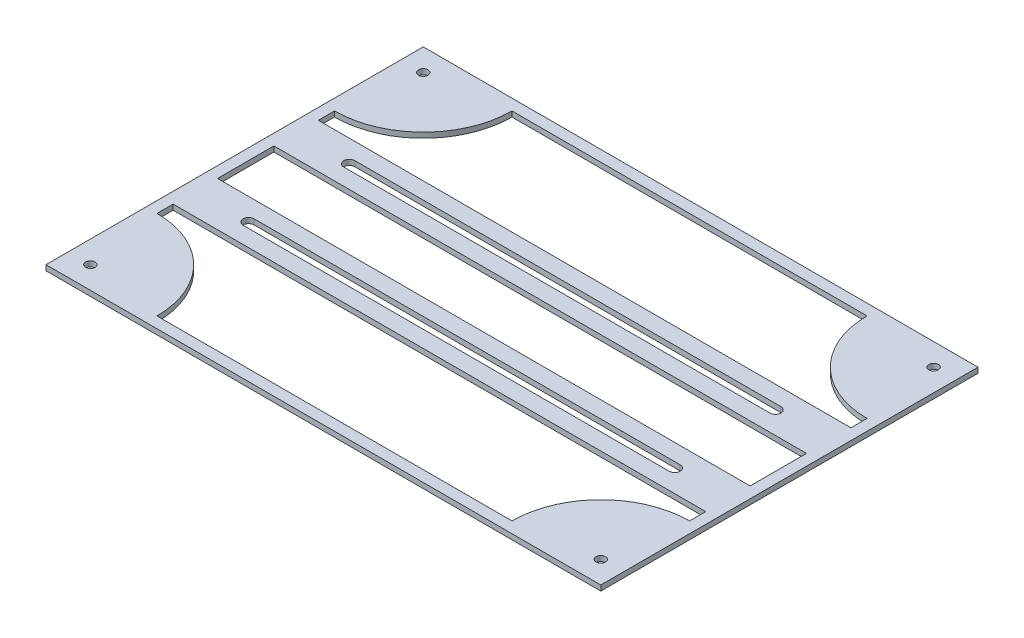
ISO-10303-21;
HEADER;
FILE_DESCRIPTION(('STEP AP214'),'2;1');
FILE_NAME('part.step','',(''),(''),'','','');
FILE_SCHEMA(('AUTOMOTIVE_DESIGN { 1 0 10303 214 1 1 1 1 }'));
ENDSEC;
DATA;
#1=APPLICATION_CONTEXT('core data for automotive mechanical design processes');
#2=APPLICATION_PROTOCOL_DEFINITION('international standard','automotive_design',2000,#1);
#3=PRODUCT_CONTEXT('',#1,'mechanical');
#4=PRODUCT('Part','Part','',(#3));
#5=PRODUCT_RELATED_PRODUCT_CATEGORY('part','',(#4));
#6=PRODUCT_DEFINITION_FORMATION('','',#4);
#7=PRODUCT_DEFINITION_CONTEXT('part definition',#1,'design');
#8=PRODUCT_DEFINITION('design','',#6,#7);
#9=PRODUCT_DEFINITION_SHAPE('','',#8);
#10=(LENGTH_UNIT() NAMED_UNIT(*) SI_UNIT(.MILLI.,.METRE.));
#11=(NAMED_UNIT(*) PLANE_ANGLE_UNIT() SI_UNIT($,.RADIAN.));
#12=(NAMED_UNIT(*) SI_UNIT($,.STERADIAN.) SOLID_ANGLE_UNIT());
#13=UNCERTAINTY_MEASURE_WITH_UNIT(LENGTH_MEASURE(1.E-05),#10,'distance_accuracy_value','');
#14=(GEOMETRIC_REPRESENTATION_CONTEXT(3) GLOBAL_UNCERTAINTY_ASSIGNED_CONTEXT((#13)) GLOBAL_UNIT_ASSIGNED_CONTEXT((#10,
#11,#12)) REPRESENTATION_CONTEXT('',''));
#15=CARTESIAN_POINT('',(0.,0.,0.));
#16=DIRECTION('',(0.,0.,1.));
#17=DIRECTION('',(1.,0.,0.));
#18=AXIS2_PLACEMENT_3D('',#15,#16,#17);
#19=CARTESIAN_POINT('',(-79.375,1.524,0.));
#20=DIRECTION('',(-1.,0.,0.));
#21=DIRECTION('',(0.,0.,1.));
#22=AXIS2_PLACEMENT_3D('',#19,#20,#21);
#23=PLANE('',#22);
#24=DIRECTION('',(0.,0.,-1.));
#25=VECTOR('',#24,1.);
#26=CARTESIAN_POINT('',(-79.375,0.,0.));
#27=LINE('',#26,#25);
#28=CARTESIAN_POINT('',(-79.375,0.,53.975));
#29=VERTEX_POINT('',#28);
#30=CARTESIAN_POINT('',(-79.375,0.,-53.975));
#31=VERTEX_POINT('',#30);
#32=EDGE_CURVE('E398',#29,#31,#27,.T.);
#33=ORIENTED_EDGE('',*,*,#32,.F.);
#34=DIRECTION('',(0.,-1.,0.));
#35=VECTOR('',#34,1.);
#36=CARTESIAN_POINT('',(-79.375,1.524,53.975));
#37=LINE('',#36,#35);
#38=CARTESIAN_POINT('',(-79.375,1.524,53.975));
#39=VERTEX_POINT('',#38);
#40=EDGE_CURVE('E11',#39,#29,#37,.T.);
#41=ORIENTED_EDGE('',*,*,#40,.F.);
#42=DIRECTION('',(0.,0.,-1.));
#43=VECTOR('',#42,1.);
#44=CARTESIAN_POINT('',(-79.375,1.524,0.));
#45=LINE('',#44,#43);
#46=CARTESIAN_POINT('',(-79.375,1.524,-53.975));
#47=VERTEX_POINT('',#46);
#48=EDGE_CURVE('E340',#39,#47,#45,.T.);
#49=ORIENTED_EDGE('',*,*,#48,.T.);
#50=DIRECTION('',(0.,-1.,0.));
#51=VECTOR('',#50,1.);
#52=CARTESIAN_POINT('',(-79.375,1.524,-53.975));
#53=LINE('',#52,#51);
#54=EDGE_CURVE('E409',#47,#31,#53,.T.);
#55=ORIENTED_EDGE('',*,*,#54,.T.);
#56=EDGE_LOOP('',(#33,#41,#49,#55));
#57=FACE_BOUND('',#56,.T.);
#58=ADVANCED_FACE('F37',(#57),#23,.T.);
#59=CARTESIAN_POINT('',(-149.463666266364,1.524,53.975));
#60=DIRECTION('',(0.,0.,1.));
#61=DIRECTION('',(1.,0.,0.));
#62=AXIS2_PLACEMENT_3D('',#59,#60,#61);
#63=PLANE('',#62);
#64=DIRECTION('',(-1.,0.,0.));
#65=VECTOR('',#64,1.);
#66=CARTESIAN_POINT('',(-149.463666266364,0.,53.975));
#67=LINE('',#66,#65);
#68=CARTESIAN_POINT('',(79.375,0.,53.975));
#69=VERTEX_POINT('',#68);
#70=EDGE_CURVE('E401',#69,#29,#67,.T.);
#71=ORIENTED_EDGE('',*,*,#70,.F.);
#72=DIRECTION('',(0.,-1.,0.));
#73=VECTOR('',#72,1.);
#74=CARTESIAN_POINT('',(79.375,1.524,53.975));
#75=LINE('',#74,#73);
#76=CARTESIAN_POINT('',(79.375,1.524,53.975));
#77=VERTEX_POINT('',#76);
#78=EDGE_CURVE('E46',#77,#69,#75,.T.);
#79=ORIENTED_EDGE('',*,*,#78,.F.);
#80=DIRECTION('',(-1.,0.,0.));
#81=VECTOR('',#80,1.);
#82=CARTESIAN_POINT('',(-149.463666266364,1.524,53.975));
#83=LINE('',#82,#81);
#84=EDGE_CURVE('E343',#77,#39,#83,.T.);
#85=ORIENTED_EDGE('',*,*,#84,.T.);
#86=ORIENTED_EDGE('',*,*,#40,.T.);
#87=EDGE_LOOP('',(#71,#79,#85,#86));
#88=FACE_BOUND('',#87,.T.);
#89=ADVANCED_FACE('F487',(#88),#63,.T.);
#90=CARTESIAN_POINT('',(79.375,1.524,0.));
#91=DIRECTION('',(-1.,0.,0.));
#92=DIRECTION('',(0.,0.,1.));
#93=AXIS2_PLACEMENT_3D('',#90,#91,#92);
#94=PLANE('',#93);
#95=DIRECTION('',(0.,0.,-1.));
#96=VECTOR('',#95,1.);
#97=CARTESIAN_POINT('',(79.375,0.,0.));
#98=LINE('',#97,#96);
#99=CARTESIAN_POINT('',(79.375,0.,-53.975));
#100=VERTEX_POINT('',#99);
#101=EDGE_CURVE('E404',#69,#100,#98,.T.);
#102=ORIENTED_EDGE('',*,*,#101,.T.);
#103=DIRECTION('',(0.,-1.,0.));
#104=VECTOR('',#103,1.);
#105=CARTESIAN_POINT('',(79.375,1.524,-53.975));
#106=LINE('',#105,#104);
#107=CARTESIAN_POINT('',(79.375,1.524,-53.975));
#108=VERTEX_POINT('',#107);
#109=EDGE_CURVE('E411',#108,#100,#106,.T.);
#110=ORIENTED_EDGE('',*,*,#109,.F.);
#111=DIRECTION('',(0.,0.,-1.));
#112=VECTOR('',#111,1.);
#113=CARTESIAN_POINT('',(79.375,1.524,0.));
#114=LINE('',#113,#112);
#115=EDGE_CURVE('E346',#77,#108,#114,.T.);
#116=ORIENTED_EDGE('',*,*,#115,.F.);
#117=ORIENTED_EDGE('',*,*,#78,.T.);
#118=EDGE_LOOP('',(#102,#110,#116,#117));
#119=FACE_BOUND('',#118,.T.);
#120=ADVANCED_FACE('F493',(#119),#94,.F.);
#121=CARTESIAN_POINT('',(76.2,1.524,0.));
#122=DIRECTION('',(-1.,0.,0.));
#123=DIRECTION('',(0.,0.,1.));
#124=AXIS2_PLACEMENT_3D('',#121,#122,#123);
#125=PLANE('',#124);
#126=DIRECTION('',(0.,0.,-1.));
#127=VECTOR('',#126,1.);
#128=CARTESIAN_POINT('',(76.2,0.,0.));
#129=LINE('',#128,#127);
#130=CARTESIAN_POINT('',(76.2,0.,8.06746468274631));
#131=VERTEX_POINT('',#130);
#132=CARTESIAN_POINT('',(76.2,0.,-8.06746468274632));
#133=VERTEX_POINT('',#132);
#134=EDGE_CURVE('E386',#131,#133,#129,.T.);
#135=ORIENTED_EDGE('',*,*,#134,.F.);
#136=DIRECTION('',(0.,-1.,0.));
#137=VECTOR('',#136,1.);
#138=CARTESIAN_POINT('',(76.2,1.524,8.06746468274631));
#139=LINE('',#138,#137);
#140=CARTESIAN_POINT('',(76.2,1.524,8.06746468274631));
#141=VERTEX_POINT('',#140);
#142=EDGE_CURVE('E412',#141,#131,#139,.T.);
#143=ORIENTED_EDGE('',*,*,#142,.F.);
#144=DIRECTION('',(0.,0.,-1.));
#145=VECTOR('',#144,1.);
#146=CARTESIAN_POINT('',(76.2,1.524,0.));
#147=LINE('',#146,#145);
#148=CARTESIAN_POINT('',(76.2,1.524,-8.06746468274632));
#149=VERTEX_POINT('',#148);
#150=EDGE_CURVE('E329',#141,#149,#147,.T.);
#151=ORIENTED_EDGE('',*,*,#150,.T.);
#152=DIRECTION('',(0.,-1.,0.));
#153=VECTOR('',#152,1.);
#154=CARTESIAN_POINT('',(76.2,1.524,-8.06746468274632));
#155=LINE('',#154,#153);
#156=EDGE_CURVE('E416',#149,#133,#155,.T.);
#157=ORIENTED_EDGE('',*,*,#156,.T.);
#158=EDGE_LOOP('',(#135,#143,#151,#157));
#159=FACE_BOUND('',#158,.T.);
#160=ADVANCED_FACE('F513',(#159),#125,.T.);
#161=CARTESIAN_POINT('',(-149.463666266364,1.524,8.06746468274631));
#162=DIRECTION('',(0.,0.,1.));
#163=DIRECTION('',(1.,0.,0.));
#164=AXIS2_PLACEMENT_3D('',#161,#162,#163);
#165=PLANE('',#164);
#166=DIRECTION('',(-1.,0.,0.));
#167=VECTOR('',#166,1.);
#168=CARTESIAN_POINT('',(-149.463666266364,0.,8.06746468274631));
#169=LINE('',#168,#167);
#170=CARTESIAN_POINT('',(-76.2,0.,8.06746468274631));
#171=VERTEX_POINT('',#170);
#172=EDGE_CURVE('E389',#131,#171,#169,.T.);
#173=ORIENTED_EDGE('',*,*,#172,.T.);
#174=DIRECTION('',(0.,-1.,0.));
#175=VECTOR('',#174,1.);
#176=CARTESIAN_POINT('',(-76.2,1.524,8.06746468274631));
#177=LINE('',#176,#175);
#178=CARTESIAN_POINT('',(-76.2,1.524,8.06746468274631));
#179=VERTEX_POINT('',#178);
#180=EDGE_CURVE('E421',#179,#171,#177,.T.);
#181=ORIENTED_EDGE('',*,*,#180,.F.);
#182=DIRECTION('',(-1.,0.,0.));
#183=VECTOR('',#182,1.);
#184=CARTESIAN_POINT('',(-149.463666266364,1.524,8.06746468274631));
#185=LINE('',#184,#183);
#186=EDGE_CURVE('E332',#141,#179,#185,.T.);
#187=ORIENTED_EDGE('',*,*,#186,.F.);
#188=ORIENTED_EDGE('',*,*,#142,.T.);
#189=EDGE_LOOP('',(#173,#181,#187,#188));
#190=FACE_BOUND('',#189,.T.);
#191=ADVANCED_FACE('F509',(#190),#165,.F.);
#192=CARTESIAN_POINT('',(-76.2,1.524,0.));
#193=DIRECTION('',(-1.,0.,0.));
#194=DIRECTION('',(0.,0.,1.));
#195=AXIS2_PLACEMENT_3D('',#192,#193,#194);
#196=PLANE('',#195);
#197=DIRECTION('',(0.,0.,-1.));
#198=VECTOR('',#197,1.);
#199=CARTESIAN_POINT('',(-76.2,0.,0.));
#200=LINE('',#199,#198);
#201=CARTESIAN_POINT('',(-76.2,0.,-8.06746468274632));
#202=VERTEX_POINT('',#201);
#203=EDGE_CURVE('E392',#171,#202,#200,.T.);
#204=ORIENTED_EDGE('',*,*,#203,.T.);
#205=DIRECTION('',(0.,-1.,0.));
#206=VECTOR('',#205,1.);
#207=CARTESIAN_POINT('',(-76.2,1.524,-8.06746468274632));
#208=LINE('',#207,#206);
#209=CARTESIAN_POINT('',(-76.2,1.524,-8.06746468274632));
#210=VERTEX_POINT('',#209);
#211=EDGE_CURVE('E418',#210,#202,#208,.T.);
#212=ORIENTED_EDGE('',*,*,#211,.F.);
#213=DIRECTION('',(0.,0.,-1.));
#214=VECTOR('',#213,1.);
#215=CARTESIAN_POINT('',(-76.2,1.524,0.));
#216=LINE('',#215,#214);
#217=EDGE_CURVE('E335',#179,#210,#216,.T.);
#218=ORIENTED_EDGE('',*,*,#217,.F.);
#219=ORIENTED_EDGE('',*,*,#180,.T.);
#220=EDGE_LOOP('',(#204,#212,#218,#219));
#221=FACE_BOUND('',#220,.T.);
#222=ADVANCED_FACE('F505',(#221),#196,.F.);
#223=CARTESIAN_POINT('',(76.2,1.524,50.8));
#224=DIRECTION('',(0.,-1.,0.));
#225=DIRECTION('',(0.,0.,-1.));
#226=AXIS2_PLACEMENT_3D('',#223,#224,#225);
#227=CYLINDRICAL_SURFACE('',#226,25.4);
#228=CARTESIAN_POINT('',(76.2,0.,50.8));
#229=DIRECTION('',(0.,1.,0.));
#230=DIRECTION('',(0.,0.,1.));
#231=AXIS2_PLACEMENT_3D('',#228,#229,#230);
#232=CIRCLE('',#231,25.4);
#233=CARTESIAN_POINT('',(50.8,0.,50.8));
#234=VERTEX_POINT('',#233);
#235=CARTESIAN_POINT('',(76.2,0.,25.4));
#236=VERTEX_POINT('',#235);
#237=EDGE_CURVE('E368',#234,#236,#232,.F.);
#238=ORIENTED_EDGE('',*,*,#237,.F.);
#239=DIRECTION('',(0.,-1.,0.));
#240=VECTOR('',#239,1.);
#241=CARTESIAN_POINT('',(50.8,1.524,50.8));
#242=LINE('',#241,#240);
#243=CARTESIAN_POINT('',(50.8,1.524,50.8));
#244=VERTEX_POINT('',#243);
#245=EDGE_CURVE('E419',#244,#234,#242,.T.);
#246=ORIENTED_EDGE('',*,*,#245,.F.);
#247=CARTESIAN_POINT('',(76.2,1.524,50.8));
#248=DIRECTION('',(0.,1.,0.));
#249=DIRECTION('',(0.,0.,1.));
#250=AXIS2_PLACEMENT_3D('',#247,#248,#249);
#251=CIRCLE('',#250,25.4);
#252=CARTESIAN_POINT('',(76.2,1.524,25.4));
#253=VERTEX_POINT('',#252);
#254=EDGE_CURVE('E312',#244,#253,#251,.F.);
#255=ORIENTED_EDGE('',*,*,#254,.T.);
#256=DIRECTION('',(0.,-1.,0.));
#257=VECTOR('',#256,1.);
#258=CARTESIAN_POINT('',(76.2,1.524,25.4));
#259=LINE('',#258,#257);
#260=EDGE_CURVE('E425',#253,#236,#259,.T.);
#261=ORIENTED_EDGE('',*,*,#260,.T.);
#262=EDGE_LOOP('',(#238,#246,#255,#261));
#263=FACE_BOUND('',#262,.T.);
#264=ADVANCED_FACE('F508',(#263),#227,.T.);
#265=CARTESIAN_POINT('',(-149.463666266364,1.524,50.8));
#266=DIRECTION('',(0.,0.,1.));
#267=DIRECTION('',(1.,0.,0.));
#268=AXIS2_PLACEMENT_3D('',#265,#266,#267);
#269=PLANE('',#268);
#270=DIRECTION('',(-1.,0.,0.));
#271=VECTOR('',#270,1.);
#272=CARTESIAN_POINT('',(-149.463666266364,0.,50.8));
#273=LINE('',#272,#271);
#274=CARTESIAN_POINT('',(-50.8,0.,50.8));
#275=VERTEX_POINT('',#274);
#276=EDGE_CURVE('E371',#234,#275,#273,.T.);
#277=ORIENTED_EDGE('',*,*,#276,.T.);
#278=DIRECTION('',(0.,-1.,0.));
#279=VECTOR('',#278,1.);
#280=CARTESIAN_POINT('',(-50.8,1.524,50.8));
#281=LINE('',#280,#279);
#282=CARTESIAN_POINT('',(-50.8,1.524,50.8));
#283=VERTEX_POINT('',#282);
#284=EDGE_CURVE('E435',#283,#275,#281,.T.);
#285=ORIENTED_EDGE('',*,*,#284,.F.);
#286=DIRECTION('',(-1.,0.,0.));
#287=VECTOR('',#286,1.);
#288=CARTESIAN_POINT('',(-149.463666266364,1.524,50.8));
#289=LINE('',#288,#287);
#290=EDGE_CURVE('E315',#244,#283,#289,.T.);
#291=ORIENTED_EDGE('',*,*,#290,.F.);
#292=ORIENTED_EDGE('',*,*,#245,.T.);
#293=EDGE_LOOP('',(#277,#285,#291,#292));
#294=FACE_BOUND('',#293,.T.);
#295=ADVANCED_FACE('F533',(#294),#269,.F.);
#296=CARTESIAN_POINT('',(-76.2,1.524,50.8));
#297=DIRECTION('',(0.,-1.,0.));
#298=DIRECTION('',(0.,0.,-1.));
#299=AXIS2_PLACEMENT_3D('',#296,#297,#298);
#300=CYLINDRICAL_SURFACE('',#299,25.4);
#301=CARTESIAN_POINT('',(-76.2,0.,50.8));
#302=DIRECTION('',(0.,1.,0.));
#303=DIRECTION('',(0.,0.,1.));
#304=AXIS2_PLACEMENT_3D('',#301,#302,#303);
#305=CIRCLE('',#304,25.4);
#306=CARTESIAN_POINT('',(-76.2,0.,25.4));
#307=VERTEX_POINT('',#306);
#308=EDGE_CURVE('E374',#275,#307,#305,.T.);
#309=ORIENTED_EDGE('',*,*,#308,.T.);
#310=DIRECTION('',(0.,-1.,0.));
#311=VECTOR('',#310,1.);
#312=CARTESIAN_POINT('',(-76.2,1.524,25.4));
#313=LINE('',#312,#311);
#314=CARTESIAN_POINT('',(-76.2,1.524,25.4));
#315=VERTEX_POINT('',#314);
#316=EDGE_CURVE('E432',#315,#307,#313,.T.);
#317=ORIENTED_EDGE('',*,*,#316,.F.);
#318=CARTESIAN_POINT('',(-76.2,1.524,50.8));
#319=DIRECTION('',(0.,1.,0.));
#320=DIRECTION('',(0.,0.,1.));
#321=AXIS2_PLACEMENT_3D('',#318,#319,#320);
#322=CIRCLE('',#321,25.4);
#323=EDGE_CURVE('E318',#283,#315,#322,.T.);
#324=ORIENTED_EDGE('',*,*,#323,.F.);
#325=ORIENTED_EDGE('',*,*,#284,.T.);
#326=EDGE_LOOP('',(#309,#317,#324,#325));
#327=FACE_BOUND('',#326,.T.);
#328=ADVANCED_FACE('F529',(#327),#300,.T.);
#329=CARTESIAN_POINT('',(-76.2000000000001,1.524,-2.13610779956955E-13));
#330=DIRECTION('',(-1.,0.,0.));
#331=DIRECTION('',(0.,0.,1.));
#332=AXIS2_PLACEMENT_3D('',#329,#330,#331);
#333=PLANE('',#332);
#334=DIRECTION('',(0.,0.,-1.));
#335=VECTOR('',#334,1.);
#336=CARTESIAN_POINT('',(-76.2000000000001,0.,-2.13610779956955E-13));
#337=LINE('',#336,#335);
#338=CARTESIAN_POINT('',(-76.2,0.,20.7674646827463));
#339=VERTEX_POINT('',#338);
#340=EDGE_CURVE('E377',#307,#339,#337,.T.);
#341=ORIENTED_EDGE('',*,*,#340,.T.);
#342=DIRECTION('',(0.,-1.,0.));
#343=VECTOR('',#342,1.);
#344=CARTESIAN_POINT('',(-76.2,1.524,20.7674646827463));
#345=LINE('',#344,#343);
#346=CARTESIAN_POINT('',(-76.2,1.524,20.7674646827463));
#347=VERTEX_POINT('',#346);
#348=EDGE_CURVE('E430',#347,#339,#345,.T.);
#349=ORIENTED_EDGE('',*,*,#348,.F.);
#350=DIRECTION('',(0.,0.,-1.));
#351=VECTOR('',#350,1.);
#352=CARTESIAN_POINT('',(-76.2000000000001,1.524,-2.13610779956955E-13));
#353=LINE('',#352,#351);
#354=EDGE_CURVE('E321',#315,#347,#353,.T.);
#355=ORIENTED_EDGE('',*,*,#354,.F.);
#356=ORIENTED_EDGE('',*,*,#316,.T.);
#357=EDGE_LOOP('',(#341,#349,#355,#356));
#358=FACE_BOUND('',#357,.T.);
#359=ADVANCED_FACE('F525',(#358),#333,.F.);
#360=CARTESIAN_POINT('',(-149.463666266364,1.524,20.7674646827463));
#361=DIRECTION('',(0.,0.,1.));
#362=DIRECTION('',(1.,0.,0.));
#363=AXIS2_PLACEMENT_3D('',#360,#361,#362);
#364=PLANE('',#363);
#365=DIRECTION('',(-1.,0.,0.));
#366=VECTOR('',#365,1.);
#367=CARTESIAN_POINT('',(-149.463666266364,0.,20.7674646827463));
#368=LINE('',#367,#366);
#369=CARTESIAN_POINT('',(76.2,0.,20.7674646827463));
#370=VERTEX_POINT('',#369);
#371=EDGE_CURVE('E380',#370,#339,#368,.T.);
#372=ORIENTED_EDGE('',*,*,#371,.F.);
#373=DIRECTION('',(0.,-1.,0.));
#374=VECTOR('',#373,1.);
#375=CARTESIAN_POINT('',(76.2,1.524,20.7674646827463));
#376=LINE('',#375,#374);
#377=CARTESIAN_POINT('',(76.2,1.524,20.7674646827463));
#378=VERTEX_POINT('',#377);
#379=EDGE_CURVE('E427',#378,#370,#376,.T.);
#380=ORIENTED_EDGE('',*,*,#379,.F.);
#381=DIRECTION('',(-1.,0.,0.));
#382=VECTOR('',#381,1.);
#383=CARTESIAN_POINT('',(-149.463666266364,1.524,20.7674646827463));
#384=LINE('',#383,#382);
#385=EDGE_CURVE('E323',#378,#347,#384,.T.);
#386=ORIENTED_EDGE('',*,*,#385,.T.);
#387=ORIENTED_EDGE('',*,*,#348,.T.);
#388=EDGE_LOOP('',(#372,#380,#386,#387));
#389=FACE_BOUND('',#388,.T.);
#390=ADVANCED_FACE('F522',(#389),#364,.T.);
#391=CARTESIAN_POINT('',(-76.2,1.524,-50.8));
#392=DIRECTION('',(0.,-1.,0.));
#393=DIRECTION('',(0.,0.,-1.));
#394=AXIS2_PLACEMENT_3D('',#391,#392,#393);
#395=CYLINDRICAL_SURFACE('',#394,25.4);
#396=CARTESIAN_POINT('',(-76.2,0.,-50.8));
#397=DIRECTION('',(0.,1.,0.));
#398=DIRECTION('',(0.,0.,1.));
#399=AXIS2_PLACEMENT_3D('',#396,#397,#398);
#400=CIRCLE('',#399,25.4);
#401=CARTESIAN_POINT('',(-50.8,0.,-50.8));
#402=VERTEX_POINT('',#401);
#403=CARTESIAN_POINT('',(-76.2,0.,-25.4));
#404=VERTEX_POINT('',#403);
#405=EDGE_CURVE('E289',#402,#404,#400,.F.);
#406=ORIENTED_EDGE('',*,*,#405,.F.);
#407=DIRECTION('',(0.,-1.,0.));
#408=VECTOR('',#407,1.);
#409=CARTESIAN_POINT('',(-50.8,1.524,-50.8));
#410=LINE('',#409,#408);
#411=CARTESIAN_POINT('',(-50.8,1.524,-50.8));
#412=VERTEX_POINT('',#411);
#413=EDGE_CURVE('E428',#412,#402,#410,.T.);
#414=ORIENTED_EDGE('',*,*,#413,.F.);
#415=CARTESIAN_POINT('',(-76.2,1.524,-50.8));
#416=DIRECTION('',(0.,1.,0.));
#417=DIRECTION('',(0.,0.,1.));
#418=AXIS2_PLACEMENT_3D('',#415,#416,#417);
#419=CIRCLE('',#418,25.4);
#420=CARTESIAN_POINT('',(-76.2,1.524,-25.4));
#421=VERTEX_POINT('',#420);
#422=EDGE_CURVE('E296',#412,#421,#419,.F.);
#423=ORIENTED_EDGE('',*,*,#422,.T.);
#424=DIRECTION('',(0.,-1.,0.));
#425=VECTOR('',#424,1.);
#426=CARTESIAN_POINT('',(-76.2,1.524,-25.4));
#427=LINE('',#426,#425);
#428=EDGE_CURVE('E351',#421,#404,#427,.T.);
#429=ORIENTED_EDGE('',*,*,#428,.T.);
#430=EDGE_LOOP('',(#406,#414,#423,#429));
#431=FACE_BOUND('',#430,.T.);
#432=ADVANCED_FACE('F39',(#431),#395,.T.);
#433=CARTESIAN_POINT('',(-149.463666266364,1.524,-50.8));
#434=DIRECTION('',(0.,0.,1.));
#435=DIRECTION('',(1.,0.,0.));
#436=AXIS2_PLACEMENT_3D('',#433,#434,#435);
#437=PLANE('',#436);
#438=DIRECTION('',(-1.,0.,0.));
#439=VECTOR('',#438,1.);
#440=CARTESIAN_POINT('',(-149.463666266364,0.,-50.8));
#441=LINE('',#440,#439);
#442=CARTESIAN_POINT('',(50.8,0.,-50.8));
#443=VERTEX_POINT('',#442);
#444=EDGE_CURVE('E354',#443,#402,#441,.T.);
#445=ORIENTED_EDGE('',*,*,#444,.F.);
#446=DIRECTION('',(0.,-1.,0.));
#447=VECTOR('',#446,1.);
#448=CARTESIAN_POINT('',(50.8,1.524,-50.8));
#449=LINE('',#448,#447);
#450=CARTESIAN_POINT('',(50.8,1.524,-50.8));
#451=VERTEX_POINT('',#450);
#452=EDGE_CURVE('E447',#451,#443,#449,.T.);
#453=ORIENTED_EDGE('',*,*,#452,.F.);
#454=DIRECTION('',(-1.,0.,0.));
#455=VECTOR('',#454,1.);
#456=CARTESIAN_POINT('',(-149.463666266364,1.524,-50.8));
#457=LINE('',#456,#455);
#458=EDGE_CURVE('E299',#451,#412,#457,.T.);
#459=ORIENTED_EDGE('',*,*,#458,.T.);
#460=ORIENTED_EDGE('',*,*,#413,.T.);
#461=EDGE_LOOP('',(#445,#453,#459,#460));
#462=FACE_BOUND('',#461,.T.);
#463=ADVANCED_FACE('F554',(#462),#437,.T.);
#464=CARTESIAN_POINT('',(76.2,1.524,-50.8));
#465=DIRECTION('',(0.,-1.,0.));
#466=DIRECTION('',(0.,0.,-1.));
#467=AXIS2_PLACEMENT_3D('',#464,#465,#466);
#468=CYLINDRICAL_SURFACE('',#467,25.4);
#469=CARTESIAN_POINT('',(76.2,0.,-50.8));
#470=DIRECTION('',(0.,1.,0.));
#471=DIRECTION('',(0.,0.,1.));
#472=AXIS2_PLACEMENT_3D('',#469,#470,#471);
#473=CIRCLE('',#472,25.4);
#474=CARTESIAN_POINT('',(76.2,0.,-25.4));
#475=VERTEX_POINT('',#474);
#476=EDGE_CURVE('E357',#443,#475,#473,.T.);
#477=ORIENTED_EDGE('',*,*,#476,.T.);
#478=DIRECTION('',(0.,-1.,0.));
#479=VECTOR('',#478,1.);
#480=CARTESIAN_POINT('',(76.2,1.524,-25.4));
#481=LINE('',#480,#479);
#482=CARTESIAN_POINT('',(76.2,1.524,-25.4));
#483=VERTEX_POINT('',#482);
#484=EDGE_CURVE('E445',#483,#475,#481,.T.);
#485=ORIENTED_EDGE('',*,*,#484,.F.);
#486=CARTESIAN_POINT('',(76.2,1.524,-50.8));
#487=DIRECTION('',(0.,1.,0.));
#488=DIRECTION('',(0.,0.,1.));
#489=AXIS2_PLACEMENT_3D('',#486,#487,#488);
#490=CIRCLE('',#489,25.4);
#491=EDGE_CURVE('E303',#451,#483,#490,.T.);
#492=ORIENTED_EDGE('',*,*,#491,.F.);
#493=ORIENTED_EDGE('',*,*,#452,.T.);
#494=EDGE_LOOP('',(#477,#485,#492,#493));
#495=FACE_BOUND('',#494,.T.);
#496=ADVANCED_FACE('F551',(#495),#468,.T.);
#497=CARTESIAN_POINT('',(76.2000000000001,1.524,-6.70158807563739E-13));
#498=DIRECTION('',(-1.,0.,0.));
#499=DIRECTION('',(0.,0.,1.));
#500=AXIS2_PLACEMENT_3D('',#497,#498,#499);
#501=PLANE('',#500);
#502=DIRECTION('',(0.,0.,-1.));
#503=VECTOR('',#502,1.);
#504=CARTESIAN_POINT('',(76.2000000000001,0.,-6.70158807563739E-13));
#505=LINE('',#504,#503);
#506=CARTESIAN_POINT('',(76.2,0.,-20.7674646827463));
#507=VERTEX_POINT('',#506);
#508=EDGE_CURVE('E360',#507,#475,#505,.T.);
#509=ORIENTED_EDGE('',*,*,#508,.F.);
#510=DIRECTION('',(0.,-1.,0.));
#511=VECTOR('',#510,1.);
#512=CARTESIAN_POINT('',(76.2,1.524,-20.7674646827463));
#513=LINE('',#512,#511);
#514=CARTESIAN_POINT('',(76.2,1.524,-20.7674646827463));
#515=VERTEX_POINT('',#514);
#516=EDGE_CURVE('E443',#515,#507,#513,.T.);
#517=ORIENTED_EDGE('',*,*,#516,.F.);
#518=DIRECTION('',(0.,0.,-1.));
#519=VECTOR('',#518,1.);
#520=CARTESIAN_POINT('',(76.2000000000001,1.524,-6.70158807563739E-13));
#521=LINE('',#520,#519);
#522=EDGE_CURVE('E305',#515,#483,#521,.T.);
#523=ORIENTED_EDGE('',*,*,#522,.T.);
#524=ORIENTED_EDGE('',*,*,#484,.T.);
#525=EDGE_LOOP('',(#509,#517,#523,#524));
#526=FACE_BOUND('',#525,.T.);
#527=ADVANCED_FACE('F547',(#526),#501,.T.);
#528=CARTESIAN_POINT('',(-149.463666266364,1.524,-20.7674646827463));
#529=DIRECTION('',(0.,0.,1.));
#530=DIRECTION('',(1.,0.,0.));
#531=AXIS2_PLACEMENT_3D('',#528,#529,#530);
#532=PLANE('',#531);
#533=DIRECTION('',(-1.,0.,0.));
#534=VECTOR('',#533,1.);
#535=CARTESIAN_POINT('',(-149.463666266364,0.,-20.7674646827463));
#536=LINE('',#535,#534);
#537=CARTESIAN_POINT('',(-76.2,0.,-20.7674646827463));
#538=VERTEX_POINT('',#537);
#539=EDGE_CURVE('E363',#507,#538,#536,.T.);
#540=ORIENTED_EDGE('',*,*,#539,.T.);
#541=DIRECTION('',(0.,-1.,0.));
#542=VECTOR('',#541,1.);
#543=CARTESIAN_POINT('',(-76.2,1.524,-20.7674646827463));
#544=LINE('',#543,#542);
#545=CARTESIAN_POINT('',(-76.2,1.524,-20.7674646827463));
#546=VERTEX_POINT('',#545);
#547=EDGE_CURVE('E440',#546,#538,#544,.T.);
#548=ORIENTED_EDGE('',*,*,#547,.F.);
#549=DIRECTION('',(-1.,0.,0.));
#550=VECTOR('',#549,1.);
#551=CARTESIAN_POINT('',(-149.463666266364,1.524,-20.7674646827463));
#552=LINE('',#551,#550);
#553=EDGE_CURVE('E308',#515,#546,#552,.T.);
#554=ORIENTED_EDGE('',*,*,#553,.F.);
#555=ORIENTED_EDGE('',*,*,#516,.T.);
#556=EDGE_LOOP('',(#540,#548,#554,#555));
#557=FACE_BOUND('',#556,.T.);
#558=ADVANCED_FACE('F503',(#557),#532,.F.);
#559=CARTESIAN_POINT('',(-149.463666266364,1.524,-8.06746468274632));
#560=DIRECTION('',(0.,0.,1.));
#561=DIRECTION('',(1.,0.,0.));
#562=AXIS2_PLACEMENT_3D('',#559,#560,#561);
#563=PLANE('',#562);
#564=DIRECTION('',(-1.,0.,0.));
#565=VECTOR('',#564,1.);
#566=CARTESIAN_POINT('',(-149.463666266364,0.,-8.06746468274632));
#567=LINE('',#566,#565);
#568=EDGE_CURVE('E395',#133,#202,#567,.T.);
#569=ORIENTED_EDGE('',*,*,#568,.F.);
#570=ORIENTED_EDGE('',*,*,#156,.F.);
#571=DIRECTION('',(-1.,0.,0.));
#572=VECTOR('',#571,1.);
#573=CARTESIAN_POINT('',(-149.463666266364,1.524,-8.06746468274632));
#574=LINE('',#573,#572);
#575=EDGE_CURVE('E337',#149,#210,#574,.T.);
#576=ORIENTED_EDGE('',*,*,#575,.T.);
#577=ORIENTED_EDGE('',*,*,#211,.T.);
#578=EDGE_LOOP('',(#569,#570,#576,#577));
#579=FACE_BOUND('',#578,.T.);
#580=ADVANCED_FACE('F499',(#579),#563,.T.);
#581=CARTESIAN_POINT('',(76.2000000000001,1.524,6.81892396326341E-13));
#582=DIRECTION('',(-1.,0.,0.));
#583=DIRECTION('',(0.,0.,1.));
#584=AXIS2_PLACEMENT_3D('',#581,#582,#583);
#585=PLANE('',#584);
#586=DIRECTION('',(0.,0.,-1.));
#587=VECTOR('',#586,1.);
#588=CARTESIAN_POINT('',(76.2000000000001,0.,6.81892396326341E-13));
#589=LINE('',#588,#587);
#590=EDGE_CURVE('E383',#236,#370,#589,.T.);
#591=ORIENTED_EDGE('',*,*,#590,.F.);
#592=ORIENTED_EDGE('',*,*,#260,.F.);
#593=DIRECTION('',(0.,0.,-1.));
#594=VECTOR('',#593,1.);
#595=CARTESIAN_POINT('',(76.2000000000001,1.524,6.81892396326341E-13));
#596=LINE('',#595,#594);
#597=EDGE_CURVE('E326',#253,#378,#596,.T.);
#598=ORIENTED_EDGE('',*,*,#597,.T.);
#599=ORIENTED_EDGE('',*,*,#379,.T.);
#600=EDGE_LOOP('',(#591,#592,#598,#599));
#601=FACE_BOUND('',#600,.T.);
#602=ADVANCED_FACE('F502',(#601),#585,.T.);
#603=CARTESIAN_POINT('',(-76.2000000000001,1.524,2.25344368719558E-13));
#604=DIRECTION('',(-1.,0.,0.));
#605=DIRECTION('',(0.,0.,1.));
#606=AXIS2_PLACEMENT_3D('',#603,#604,#605);
#607=PLANE('',#606);
#608=DIRECTION('',(0.,0.,-1.));
#609=VECTOR('',#608,1.);
#610=CARTESIAN_POINT('',(-76.2000000000001,0.,2.25344368719558E-13));
#611=LINE('',#610,#609);
#612=EDGE_CURVE('E365',#538,#404,#611,.T.);
#613=ORIENTED_EDGE('',*,*,#612,.T.);
#614=ORIENTED_EDGE('',*,*,#428,.F.);
#615=DIRECTION('',(0.,0.,-1.));
#616=VECTOR('',#615,1.);
#617=CARTESIAN_POINT('',(-76.2000000000001,1.524,2.25344368719558E-13));
#618=LINE('',#617,#616);
#619=EDGE_CURVE('E310',#546,#421,#618,.T.);
#620=ORIENTED_EDGE('',*,*,#619,.F.);
#621=ORIENTED_EDGE('',*,*,#547,.T.);
#622=EDGE_LOOP('',(#613,#614,#620,#621));
#623=FACE_BOUND('',#622,.T.);
#624=ADVANCED_FACE('F520',(#623),#607,.F.);
#625=CARTESIAN_POINT('',(-149.463666266364,1.524,-53.975));
#626=DIRECTION('',(0.,0.,1.));
#627=DIRECTION('',(1.,0.,0.));
#628=AXIS2_PLACEMENT_3D('',#625,#626,#627);
#629=PLANE('',#628);
#630=DIRECTION('',(-1.,0.,0.));
#631=VECTOR('',#630,1.);
#632=CARTESIAN_POINT('',(-149.463666266364,0.,-53.975));
#633=LINE('',#632,#631);
#634=EDGE_CURVE('E300',#100,#31,#633,.T.);
#635=ORIENTED_EDGE('',*,*,#634,.T.);
#636=ORIENTED_EDGE('',*,*,#54,.F.);
#637=DIRECTION('',(-1.,0.,0.));
#638=VECTOR('',#637,1.);
#639=CARTESIAN_POINT('',(-149.463666266364,1.524,-53.975));
#640=LINE('',#639,#638);
#641=EDGE_CURVE('E349',#108,#47,#640,.T.);
#642=ORIENTED_EDGE('',*,*,#641,.F.);
#643=ORIENTED_EDGE('',*,*,#109,.T.);
#644=EDGE_LOOP('',(#635,#636,#642,#643));
#645=FACE_BOUND('',#644,.T.);
#646=ADVANCED_FACE('F543',(#645),#629,.F.);
#647=CARTESIAN_POINT('',(-149.463666266364,1.524,0.));
#648=DIRECTION('',(0.,1.,0.));
#649=DIRECTION('',(0.,0.,1.));
#650=AXIS2_PLACEMENT_3D('',#647,#648,#649);
#651=PLANE('',#650);
#652=CARTESIAN_POINT('',(-73.025,1.524,-47.625));
#653=DIRECTION('',(0.,1.,0.));
#654=DIRECTION('',(0.,0.,1.));
#655=AXIS2_PLACEMENT_3D('',#652,#653,#654);
#656=CIRCLE('',#655,1.35254999999999);
#657=CARTESIAN_POINT('',(-73.025,1.524,-46.27245));
#658=VERTEX_POINT('',#657);
#659=EDGE_CURVE('E466',#658,#658,#656,.T.);
#660=ORIENTED_EDGE('',*,*,#659,.F.);
#661=EDGE_LOOP('',(#660));
#662=FACE_BOUND('',#661,.T.);
#663=CARTESIAN_POINT('',(-73.025,1.524,47.625));
#664=DIRECTION('',(0.,1.,0.));
#665=DIRECTION('',(0.,0.,1.));
#666=AXIS2_PLACEMENT_3D('',#663,#664,#665);
#667=CIRCLE('',#666,1.35254999999999);
#668=CARTESIAN_POINT('',(-73.025,1.524,48.97755));
#669=VERTEX_POINT('',#668);
#670=EDGE_CURVE('E41',#669,#669,#667,.T.);
#671=ORIENTED_EDGE('',*,*,#670,.F.);
#672=EDGE_LOOP('',(#671));
#673=FACE_BOUND('',#672,.T.);
#674=CARTESIAN_POINT('',(73.025,1.524,47.625));
#675=DIRECTION('',(0.,1.,0.));
#676=DIRECTION('',(0.,0.,1.));
#677=AXIS2_PLACEMENT_3D('',#674,#675,#676);
#678=CIRCLE('',#677,1.35254999999999);
#679=CARTESIAN_POINT('',(73.025,1.524,48.97755));
#680=VERTEX_POINT('',#679);
#681=EDGE_CURVE('E453',#680,#680,#678,.T.);
#682=ORIENTED_EDGE('',*,*,#681,.F.);
#683=EDGE_LOOP('',(#682));
#684=FACE_BOUND('',#683,.T.);
#685=CARTESIAN_POINT('',(73.025,1.524,-47.625));
#686=DIRECTION('',(0.,1.,0.));
#687=DIRECTION('',(0.,0.,1.));
#688=AXIS2_PLACEMENT_3D('',#685,#686,#687);
#689=CIRCLE('',#688,1.35254999999999);
#690=CARTESIAN_POINT('',(73.025,1.524,-46.27245));
#691=VERTEX_POINT('',#690);
#692=EDGE_CURVE('E254',#691,#691,#689,.T.);
#693=ORIENTED_EDGE('',*,*,#692,.F.);
#694=EDGE_LOOP('',(#693));
#695=FACE_BOUND('',#694,.T.);
#696=CARTESIAN_POINT('',(-60.96,1.524,14.4174646827463));
#697=DIRECTION('',(0.,1.,0.));
#698=DIRECTION('',(0.,0.,-1.));
#699=AXIS2_PLACEMENT_3D('',#696,#697,#698);
#700=CIRCLE('',#699,1.5875);
#701=CARTESIAN_POINT('',(-60.96,1.524,12.8299646827463));
#702=VERTEX_POINT('',#701);
#703=CARTESIAN_POINT('',(-60.96,1.524,16.0049646827463));
#704=VERTEX_POINT('',#703);
#705=EDGE_CURVE('E54',#702,#704,#700,.T.);
#706=ORIENTED_EDGE('',*,*,#705,.F.);
#707=DIRECTION('',(-1.,0.,0.));
#708=VECTOR('',#707,1.);
#709=CARTESIAN_POINT('',(-60.96,1.524,12.8299646827463));
#710=LINE('',#709,#708);
#711=CARTESIAN_POINT('',(60.96,1.524,12.8299646827463));
#712=VERTEX_POINT('',#711);
#713=EDGE_CURVE('E241',#712,#702,#710,.T.);
#714=ORIENTED_EDGE('',*,*,#713,.F.);
#715=CARTESIAN_POINT('',(60.96,1.524,14.4174646827463));
#716=DIRECTION('',(0.,1.,0.));
#717=DIRECTION('',(0.,0.,-1.));
#718=AXIS2_PLACEMENT_3D('',#715,#716,#717);
#719=CIRCLE('',#718,1.5875);
#720=CARTESIAN_POINT('',(60.96,1.524,16.0049646827463));
#721=VERTEX_POINT('',#720);
#722=EDGE_CURVE('E244',#721,#712,#719,.T.);
#723=ORIENTED_EDGE('',*,*,#722,.F.);
#724=DIRECTION('',(1.,0.,0.));
#725=VECTOR('',#724,1.);
#726=CARTESIAN_POINT('',(-60.96,1.524,16.0049646827463));
#727=LINE('',#726,#725);
#728=EDGE_CURVE('E253',#704,#721,#727,.T.);
#729=ORIENTED_EDGE('',*,*,#728,.F.);
#730=EDGE_LOOP('',(#706,#714,#723,#729));
#731=FACE_BOUND('',#730,.T.);
#732=CARTESIAN_POINT('',(-60.96,1.524,-14.4174646827463));
#733=DIRECTION('',(0.,1.,0.));
#734=DIRECTION('',(0.,0.,1.));
#735=AXIS2_PLACEMENT_3D('',#732,#733,#734);
#736=CIRCLE('',#735,1.5875);
#737=CARTESIAN_POINT('',(-60.96,1.524,-16.0049646827463));
#738=VERTEX_POINT('',#737);
#739=CARTESIAN_POINT('',(-60.96,1.524,-12.8299646827463));
#740=VERTEX_POINT('',#739);
#741=EDGE_CURVE('E260',#738,#740,#736,.T.);
#742=ORIENTED_EDGE('',*,*,#741,.F.);
#743=DIRECTION('',(-1.,0.,0.));
#744=VECTOR('',#743,1.);
#745=CARTESIAN_POINT('',(-60.96,1.524,-16.0049646827463));
#746=LINE('',#745,#744);
#747=CARTESIAN_POINT('',(60.96,1.524,-16.0049646827463));
#748=VERTEX_POINT('',#747);
#749=EDGE_CURVE('E268',#748,#738,#746,.T.);
#750=ORIENTED_EDGE('',*,*,#749,.F.);
#751=CARTESIAN_POINT('',(60.96,1.524,-14.4174646827463));
#752=DIRECTION('',(0.,1.,0.));
#753=DIRECTION('',(0.,0.,1.));
#754=AXIS2_PLACEMENT_3D('',#751,#752,#753);
#755=CIRCLE('',#754,1.5875);
#756=CARTESIAN_POINT('',(60.96,1.524,-12.8299646827463));
#757=VERTEX_POINT('',#756);
#758=EDGE_CURVE('E282',#757,#748,#755,.T.);
#759=ORIENTED_EDGE('',*,*,#758,.F.);
#760=DIRECTION('',(1.,0.,0.));
#761=VECTOR('',#760,1.);
#762=CARTESIAN_POINT('',(-60.96,1.524,-12.8299646827463));
#763=LINE('',#762,#761);
#764=EDGE_CURVE('E279',#740,#757,#763,.T.);
#765=ORIENTED_EDGE('',*,*,#764,.F.);
#766=EDGE_LOOP('',(#742,#750,#759,#765));
#767=FACE_BOUND('',#766,.T.);
#768=ORIENTED_EDGE('',*,*,#422,.F.);
#769=ORIENTED_EDGE('',*,*,#458,.F.);
#770=ORIENTED_EDGE('',*,*,#491,.T.);
#771=ORIENTED_EDGE('',*,*,#522,.F.);
#772=ORIENTED_EDGE('',*,*,#553,.T.);
#773=ORIENTED_EDGE('',*,*,#619,.T.);
#774=EDGE_LOOP('',(#768,#769,#770,#771,#772,#773));
#775=FACE_BOUND('',#774,.T.);
#776=ORIENTED_EDGE('',*,*,#254,.F.);
#777=ORIENTED_EDGE('',*,*,#290,.T.);
#778=ORIENTED_EDGE('',*,*,#323,.T.);
#779=ORIENTED_EDGE('',*,*,#354,.T.);
#780=ORIENTED_EDGE('',*,*,#385,.F.);
#781=ORIENTED_EDGE('',*,*,#597,.F.);
#782=EDGE_LOOP('',(#776,#777,#778,#779,#780,#781));
#783=FACE_BOUND('',#782,.T.);
#784=ORIENTED_EDGE('',*,*,#150,.F.);
#785=ORIENTED_EDGE('',*,*,#186,.T.);
#786=ORIENTED_EDGE('',*,*,#217,.T.);
#787=ORIENTED_EDGE('',*,*,#575,.F.);
#788=EDGE_LOOP('',(#784,#785,#786,#787));
#789=FACE_BOUND('',#788,.T.);
#790=ORIENTED_EDGE('',*,*,#48,.F.);
#791=ORIENTED_EDGE('',*,*,#84,.F.);
#792=ORIENTED_EDGE('',*,*,#115,.T.);
#793=ORIENTED_EDGE('',*,*,#641,.T.);
#794=EDGE_LOOP('',(#790,#791,#792,#793));
#795=FACE_BOUND('',#794,.T.);
#796=ADVANCED_FACE('F576',(#662,#673,#684,#695,#731,#767,#775,#783,#789,#795),#651,.T.);
#797=CARTESIAN_POINT('',(-149.463666266364,0.,0.));
#798=DIRECTION('',(0.,1.,0.));
#799=DIRECTION('',(0.,0.,1.));
#800=AXIS2_PLACEMENT_3D('',#797,#798,#799);
#801=PLANE('',#800);
#802=CARTESIAN_POINT('',(-73.025,0.,-47.625));
#803=DIRECTION('',(0.,1.,0.));
#804=DIRECTION('',(0.,0.,1.));
#805=AXIS2_PLACEMENT_3D('',#802,#803,#804);
#806=CIRCLE('',#805,1.35254999999999);
#807=CARTESIAN_POINT('',(-73.025,0.,-46.27245));
#808=VERTEX_POINT('',#807);
#809=EDGE_CURVE('E469',#808,#808,#806,.T.);
#810=ORIENTED_EDGE('',*,*,#809,.T.);
#811=EDGE_LOOP('',(#810));
#812=FACE_BOUND('',#811,.T.);
#813=CARTESIAN_POINT('',(-73.025,0.,47.625));
#814=DIRECTION('',(0.,1.,0.));
#815=DIRECTION('',(0.,0.,1.));
#816=AXIS2_PLACEMENT_3D('',#813,#814,#815);
#817=CIRCLE('',#816,1.35254999999999);
#818=CARTESIAN_POINT('',(-73.025,0.,48.97755));
#819=VERTEX_POINT('',#818);
#820=EDGE_CURVE('E463',#819,#819,#817,.T.);
#821=ORIENTED_EDGE('',*,*,#820,.T.);
#822=EDGE_LOOP('',(#821));
#823=FACE_BOUND('',#822,.T.);
#824=CARTESIAN_POINT('',(73.025,0.,47.625));
#825=DIRECTION('',(0.,1.,0.));
#826=DIRECTION('',(0.,0.,1.));
#827=AXIS2_PLACEMENT_3D('',#824,#825,#826);
#828=CIRCLE('',#827,1.35254999999999);
#829=CARTESIAN_POINT('',(73.025,0.,48.97755));
#830=VERTEX_POINT('',#829);
#831=EDGE_CURVE('E457',#830,#830,#828,.T.);
#832=ORIENTED_EDGE('',*,*,#831,.T.);
#833=EDGE_LOOP('',(#832));
#834=FACE_BOUND('',#833,.T.);
#835=CARTESIAN_POINT('',(73.025,0.,-47.625));
#836=DIRECTION('',(0.,1.,0.));
#837=DIRECTION('',(0.,0.,1.));
#838=AXIS2_PLACEMENT_3D('',#835,#836,#837);
#839=CIRCLE('',#838,1.35254999999999);
#840=CARTESIAN_POINT('',(73.025,0.,-46.27245));
#841=VERTEX_POINT('',#840);
#842=EDGE_CURVE('E247',#841,#841,#839,.T.);
#843=ORIENTED_EDGE('',*,*,#842,.T.);
#844=EDGE_LOOP('',(#843));
#845=FACE_BOUND('',#844,.T.);
#846=DIRECTION('',(-1.,0.,0.));
#847=VECTOR('',#846,1.);
#848=CARTESIAN_POINT('',(-60.96,0.,12.8299646827463));
#849=LINE('',#848,#847);
#850=CARTESIAN_POINT('',(60.96,0.,12.8299646827463));
#851=VERTEX_POINT('',#850);
#852=CARTESIAN_POINT('',(-60.96,0.,12.8299646827463));
#853=VERTEX_POINT('',#852);
#854=EDGE_CURVE('E231',#851,#853,#849,.T.);
#855=ORIENTED_EDGE('',*,*,#854,.T.);
#856=CARTESIAN_POINT('',(-60.96,0.,14.4174646827463));
#857=DIRECTION('',(0.,1.,0.));
#858=DIRECTION('',(0.,0.,-1.));
#859=AXIS2_PLACEMENT_3D('',#856,#857,#858);
#860=CIRCLE('',#859,1.5875);
#861=CARTESIAN_POINT('',(-60.96,0.,16.0049646827463));
#862=VERTEX_POINT('',#861);
#863=EDGE_CURVE('E225',#853,#862,#860,.T.);
#864=ORIENTED_EDGE('',*,*,#863,.T.);
#865=DIRECTION('',(1.,0.,0.));
#866=VECTOR('',#865,1.);
#867=CARTESIAN_POINT('',(-60.96,0.,16.0049646827463));
#868=LINE('',#867,#866);
#869=CARTESIAN_POINT('',(60.96,0.,16.0049646827463));
#870=VERTEX_POINT('',#869);
#871=EDGE_CURVE('E234',#862,#870,#868,.T.);
#872=ORIENTED_EDGE('',*,*,#871,.T.);
#873=CARTESIAN_POINT('',(60.96,0.,14.4174646827463));
#874=DIRECTION('',(0.,1.,0.));
#875=DIRECTION('',(0.,0.,-1.));
#876=AXIS2_PLACEMENT_3D('',#873,#874,#875);
#877=CIRCLE('',#876,1.5875);
#878=EDGE_CURVE('E62',#870,#851,#877,.T.);
#879=ORIENTED_EDGE('',*,*,#878,.T.);
#880=EDGE_LOOP('',(#855,#864,#872,#879));
#881=FACE_BOUND('',#880,.T.);
#882=DIRECTION('',(-1.,0.,0.));
#883=VECTOR('',#882,1.);
#884=CARTESIAN_POINT('',(-60.96,0.,-16.0049646827463));
#885=LINE('',#884,#883);
#886=CARTESIAN_POINT('',(60.96,0.,-16.0049646827463));
#887=VERTEX_POINT('',#886);
#888=CARTESIAN_POINT('',(-60.96,0.,-16.0049646827463));
#889=VERTEX_POINT('',#888);
#890=EDGE_CURVE('E274',#887,#889,#885,.T.);
#891=ORIENTED_EDGE('',*,*,#890,.T.);
#892=CARTESIAN_POINT('',(-60.96,0.,-14.4174646827463));
#893=DIRECTION('',(0.,1.,0.));
#894=DIRECTION('',(0.,0.,1.));
#895=AXIS2_PLACEMENT_3D('',#892,#893,#894);
#896=CIRCLE('',#895,1.5875);
#897=CARTESIAN_POINT('',(-60.96,0.,-12.8299646827463));
#898=VERTEX_POINT('',#897);
#899=EDGE_CURVE('E264',#889,#898,#896,.T.);
#900=ORIENTED_EDGE('',*,*,#899,.T.);
#901=DIRECTION('',(1.,0.,0.));
#902=VECTOR('',#901,1.);
#903=CARTESIAN_POINT('',(-60.96,0.,-12.8299646827463));
#904=LINE('',#903,#902);
#905=CARTESIAN_POINT('',(60.96,0.,-12.8299646827463));
#906=VERTEX_POINT('',#905);
#907=EDGE_CURVE('E267',#898,#906,#904,.T.);
#908=ORIENTED_EDGE('',*,*,#907,.T.);
#909=CARTESIAN_POINT('',(60.96,0.,-14.4174646827463));
#910=DIRECTION('',(0.,1.,0.));
#911=DIRECTION('',(0.,0.,1.));
#912=AXIS2_PLACEMENT_3D('',#909,#910,#911);
#913=CIRCLE('',#912,1.5875);
#914=EDGE_CURVE('E271',#906,#887,#913,.T.);
#915=ORIENTED_EDGE('',*,*,#914,.T.);
#916=EDGE_LOOP('',(#891,#900,#908,#915));
#917=FACE_BOUND('',#916,.T.);
#918=ORIENTED_EDGE('',*,*,#405,.T.);
#919=ORIENTED_EDGE('',*,*,#612,.F.);
#920=ORIENTED_EDGE('',*,*,#539,.F.);
#921=ORIENTED_EDGE('',*,*,#508,.T.);
#922=ORIENTED_EDGE('',*,*,#476,.F.);
#923=ORIENTED_EDGE('',*,*,#444,.T.);
#924=EDGE_LOOP('',(#918,#919,#920,#921,#922,#923));
#925=FACE_BOUND('',#924,.T.);
#926=ORIENTED_EDGE('',*,*,#237,.T.);
#927=ORIENTED_EDGE('',*,*,#590,.T.);
#928=ORIENTED_EDGE('',*,*,#371,.T.);
#929=ORIENTED_EDGE('',*,*,#340,.F.);
#930=ORIENTED_EDGE('',*,*,#308,.F.);
#931=ORIENTED_EDGE('',*,*,#276,.F.);
#932=EDGE_LOOP('',(#926,#927,#928,#929,#930,#931));
#933=FACE_BOUND('',#932,.T.);
#934=ORIENTED_EDGE('',*,*,#134,.T.);
#935=ORIENTED_EDGE('',*,*,#568,.T.);
#936=ORIENTED_EDGE('',*,*,#203,.F.);
#937=ORIENTED_EDGE('',*,*,#172,.F.);
#938=EDGE_LOOP('',(#934,#935,#936,#937));
#939=FACE_BOUND('',#938,.T.);
#940=ORIENTED_EDGE('',*,*,#32,.T.);
#941=ORIENTED_EDGE('',*,*,#634,.F.);
#942=ORIENTED_EDGE('',*,*,#101,.F.);
#943=ORIENTED_EDGE('',*,*,#70,.T.);
#944=EDGE_LOOP('',(#940,#941,#942,#943));
#945=FACE_BOUND('',#944,.T.);
#946=ADVANCED_FACE('F238',(#812,#823,#834,#845,#881,#917,#925,#933,#939,#945),#801,.F.);
#947=CARTESIAN_POINT('',(-60.96,0.,-14.4174646827463));
#948=DIRECTION('',(0.,1.,0.));
#949=DIRECTION('',(0.,0.,1.));
#950=AXIS2_PLACEMENT_3D('',#947,#948,#949);
#951=CYLINDRICAL_SURFACE('',#950,1.5875);
#952=ORIENTED_EDGE('',*,*,#741,.T.);
#953=DIRECTION('',(0.,1.,0.));
#954=VECTOR('',#953,1.);
#955=CARTESIAN_POINT('',(-60.96,0.,-12.8299646827463));
#956=LINE('',#955,#954);
#957=EDGE_CURVE('E277',#898,#740,#956,.T.);
#958=ORIENTED_EDGE('',*,*,#957,.F.);
#959=ORIENTED_EDGE('',*,*,#899,.F.);
#960=DIRECTION('',(0.,1.,0.));
#961=VECTOR('',#960,1.);
#962=CARTESIAN_POINT('',(-60.96,0.,-16.0049646827463));
#963=LINE('',#962,#961);
#964=EDGE_CURVE('E287',#889,#738,#963,.T.);
#965=ORIENTED_EDGE('',*,*,#964,.T.);
#966=EDGE_LOOP('',(#952,#958,#959,#965));
#967=FACE_BOUND('',#966,.T.);
#968=ADVANCED_FACE('F602',(#967),#951,.F.);
#969=CARTESIAN_POINT('',(-60.96,0.,-16.0049646827463));
#970=DIRECTION('',(0.,0.,-1.));
#971=DIRECTION('',(-1.,0.,0.));
#972=AXIS2_PLACEMENT_3D('',#969,#970,#971);
#973=PLANE('',#972);
#974=ORIENTED_EDGE('',*,*,#749,.T.);
#975=ORIENTED_EDGE('',*,*,#964,.F.);
#976=ORIENTED_EDGE('',*,*,#890,.F.);
#977=DIRECTION('',(0.,1.,0.));
#978=VECTOR('',#977,1.);
#979=CARTESIAN_POINT('',(60.96,0.,-16.0049646827463));
#980=LINE('',#979,#978);
#981=EDGE_CURVE('E290',#887,#748,#980,.T.);
#982=ORIENTED_EDGE('',*,*,#981,.T.);
#983=EDGE_LOOP('',(#974,#975,#976,#982));
#984=FACE_BOUND('',#983,.T.);
#985=ADVANCED_FACE('F607',(#984),#973,.F.);
#986=CARTESIAN_POINT('',(60.96,0.,-14.4174646827463));
#987=DIRECTION('',(0.,1.,0.));
#988=DIRECTION('',(0.,0.,1.));
#989=AXIS2_PLACEMENT_3D('',#986,#987,#988);
#990=CYLINDRICAL_SURFACE('',#989,1.5875);
#991=ORIENTED_EDGE('',*,*,#758,.T.);
#992=ORIENTED_EDGE('',*,*,#981,.F.);
#993=ORIENTED_EDGE('',*,*,#914,.F.);
#994=DIRECTION('',(0.,1.,0.));
#995=VECTOR('',#994,1.);
#996=CARTESIAN_POINT('',(60.96,0.,-12.8299646827463));
#997=LINE('',#996,#995);
#998=EDGE_CURVE('E292',#906,#757,#997,.T.);
#999=ORIENTED_EDGE('',*,*,#998,.T.);
#1000=EDGE_LOOP('',(#991,#992,#993,#999));
#1001=FACE_BOUND('',#1000,.T.);
#1002=ADVANCED_FACE('F716',(#1001),#990,.F.);
#1003=CARTESIAN_POINT('',(-60.96,0.,-12.8299646827463));
#1004=DIRECTION('',(0.,0.,1.));
#1005=DIRECTION('',(1.,0.,0.));
#1006=AXIS2_PLACEMENT_3D('',#1003,#1004,#1005);
#1007=PLANE('',#1006);
#1008=ORIENTED_EDGE('',*,*,#764,.T.);
#1009=ORIENTED_EDGE('',*,*,#998,.F.);
#1010=ORIENTED_EDGE('',*,*,#907,.F.);
#1011=ORIENTED_EDGE('',*,*,#957,.T.);
#1012=EDGE_LOOP('',(#1008,#1009,#1010,#1011));
#1013=FACE_BOUND('',#1012,.T.);
#1014=ADVANCED_FACE('F726',(#1013),#1007,.F.);
#1015=CARTESIAN_POINT('',(-60.96,0.,14.4174646827463));
#1016=DIRECTION('',(0.,1.,0.));
#1017=DIRECTION('',(0.,0.,1.));
#1018=AXIS2_PLACEMENT_3D('',#1015,#1016,#1017);
#1019=CYLINDRICAL_SURFACE('',#1018,1.5875);
#1020=ORIENTED_EDGE('',*,*,#705,.T.);
#1021=DIRECTION('',(0.,1.,0.));
#1022=VECTOR('',#1021,1.);
#1023=CARTESIAN_POINT('',(-60.96,0.,16.0049646827463));
#1024=LINE('',#1023,#1022);
#1025=EDGE_CURVE('E221',#862,#704,#1024,.T.);
#1026=ORIENTED_EDGE('',*,*,#1025,.F.);
#1027=ORIENTED_EDGE('',*,*,#863,.F.);
#1028=DIRECTION('',(0.,1.,0.));
#1029=VECTOR('',#1028,1.);
#1030=CARTESIAN_POINT('',(-60.96,0.,12.8299646827463));
#1031=LINE('',#1030,#1029);
#1032=EDGE_CURVE('E258',#853,#702,#1031,.T.);
#1033=ORIENTED_EDGE('',*,*,#1032,.T.);
#1034=EDGE_LOOP('',(#1020,#1026,#1027,#1033));
#1035=FACE_BOUND('',#1034,.T.);
#1036=ADVANCED_FACE('F223',(#1035),#1019,.F.);
#1037=CARTESIAN_POINT('',(-60.96,0.,12.8299646827463));
#1038=DIRECTION('',(0.,0.,-1.));
#1039=DIRECTION('',(-1.,0.,0.));
#1040=AXIS2_PLACEMENT_3D('',#1037,#1038,#1039);
#1041=PLANE('',#1040);
#1042=ORIENTED_EDGE('',*,*,#713,.T.);
#1043=ORIENTED_EDGE('',*,*,#1032,.F.);
#1044=ORIENTED_EDGE('',*,*,#854,.F.);
#1045=DIRECTION('',(0.,1.,0.));
#1046=VECTOR('',#1045,1.);
#1047=CARTESIAN_POINT('',(60.96,0.,12.8299646827463));
#1048=LINE('',#1047,#1046);
#1049=EDGE_CURVE('E261',#851,#712,#1048,.T.);
#1050=ORIENTED_EDGE('',*,*,#1049,.T.);
#1051=EDGE_LOOP('',(#1042,#1043,#1044,#1050));
#1052=FACE_BOUND('',#1051,.T.);
#1053=ADVANCED_FACE('F745',(#1052),#1041,.F.);
#1054=CARTESIAN_POINT('',(60.96,0.,14.4174646827463));
#1055=DIRECTION('',(0.,1.,0.));
#1056=DIRECTION('',(0.,0.,1.));
#1057=AXIS2_PLACEMENT_3D('',#1054,#1055,#1056);
#1058=CYLINDRICAL_SURFACE('',#1057,1.5875);
#1059=ORIENTED_EDGE('',*,*,#722,.T.);
#1060=ORIENTED_EDGE('',*,*,#1049,.F.);
#1061=ORIENTED_EDGE('',*,*,#878,.F.);
#1062=DIRECTION('',(0.,1.,0.));
#1063=VECTOR('',#1062,1.);
#1064=CARTESIAN_POINT('',(60.96,0.,16.0049646827463));
#1065=LINE('',#1064,#1063);
#1066=EDGE_CURVE('E230',#870,#721,#1065,.T.);
#1067=ORIENTED_EDGE('',*,*,#1066,.T.);
#1068=EDGE_LOOP('',(#1059,#1060,#1061,#1067));
#1069=FACE_BOUND('',#1068,.T.);
#1070=ADVANCED_FACE('F754',(#1069),#1058,.F.);
#1071=CARTESIAN_POINT('',(-60.96,0.,16.0049646827463));
#1072=DIRECTION('',(0.,0.,1.));
#1073=DIRECTION('',(1.,0.,0.));
#1074=AXIS2_PLACEMENT_3D('',#1071,#1072,#1073);
#1075=PLANE('',#1074);
#1076=ORIENTED_EDGE('',*,*,#728,.T.);
#1077=ORIENTED_EDGE('',*,*,#1066,.F.);
#1078=ORIENTED_EDGE('',*,*,#871,.F.);
#1079=ORIENTED_EDGE('',*,*,#1025,.T.);
#1080=EDGE_LOOP('',(#1076,#1077,#1078,#1079));
#1081=FACE_BOUND('',#1080,.T.);
#1082=ADVANCED_FACE('F235',(#1081),#1075,.F.);
#1083=CARTESIAN_POINT('',(73.025,7.8105,-47.625));
#1084=DIRECTION('',(0.,1.,0.));
#1085=DIRECTION('',(0.,0.,1.));
#1086=AXIS2_PLACEMENT_3D('',#1083,#1084,#1085);
#1087=CYLINDRICAL_SURFACE('',#1086,1.35254999999999);
#1088=ORIENTED_EDGE('',*,*,#692,.T.);
#1089=EDGE_LOOP('',(#1088));
#1090=FACE_BOUND('',#1089,.T.);
#1091=ORIENTED_EDGE('',*,*,#842,.F.);
#1092=EDGE_LOOP('',(#1091));
#1093=FACE_BOUND('',#1092,.T.);
#1094=ADVANCED_FACE('F772',(#1090,#1093),#1087,.F.);
#1095=CARTESIAN_POINT('',(73.025,7.8105,47.625));
#1096=DIRECTION('',(0.,1.,0.));
#1097=DIRECTION('',(0.,0.,1.));
#1098=AXIS2_PLACEMENT_3D('',#1095,#1096,#1097);
#1099=CYLINDRICAL_SURFACE('',#1098,1.35254999999999);
#1100=ORIENTED_EDGE('',*,*,#681,.T.);
#1101=EDGE_LOOP('',(#1100));
#1102=FACE_BOUND('',#1101,.T.);
#1103=ORIENTED_EDGE('',*,*,#831,.F.);
#1104=EDGE_LOOP('',(#1103));
#1105=FACE_BOUND('',#1104,.T.);
#1106=ADVANCED_FACE('F483',(#1102,#1105),#1099,.F.);
#1107=CARTESIAN_POINT('',(-73.025,7.8105,47.625));
#1108=DIRECTION('',(0.,1.,0.));
#1109=DIRECTION('',(0.,0.,1.));
#1110=AXIS2_PLACEMENT_3D('',#1107,#1108,#1109);
#1111=CYLINDRICAL_SURFACE('',#1110,1.35254999999999);
#1112=ORIENTED_EDGE('',*,*,#670,.T.);
#1113=EDGE_LOOP('',(#1112));
#1114=FACE_BOUND('',#1113,.T.);
#1115=ORIENTED_EDGE('',*,*,#820,.F.);
#1116=EDGE_LOOP('',(#1115));
#1117=FACE_BOUND('',#1116,.T.);
#1118=ADVANCED_FACE('F477',(#1114,#1117),#1111,.F.);
#1119=CARTESIAN_POINT('',(-73.025,7.8105,-47.625));
#1120=DIRECTION('',(0.,1.,0.));
#1121=DIRECTION('',(0.,0.,1.));
#1122=AXIS2_PLACEMENT_3D('',#1119,#1120,#1121);
#1123=CYLINDRICAL_SURFACE('',#1122,1.35254999999999);
#1124=ORIENTED_EDGE('',*,*,#659,.T.);
#1125=EDGE_LOOP('',(#1124));
#1126=FACE_BOUND('',#1125,.T.);
#1127=ORIENTED_EDGE('',*,*,#809,.F.);
#1128=EDGE_LOOP('',(#1127));
#1129=FACE_BOUND('',#1128,.T.);
#1130=ADVANCED_FACE('F475',(#1126,#1129),#1123,.F.);
#1131=CLOSED_SHELL('',(#58,#89,#120,#160,#191,#222,#264,#295,#328,#359,#390,#432,#463,#496,#527,
#558,#580,#602,#624,#646,#796,#946,#968,#985,#1002,#1014,#1036,#1053,#1070,#1082,#1094,#1106,
#1118,#1130));
#1132=MANIFOLD_SOLID_BREP('B2',#1131);
#1133=ADVANCED_BREP_SHAPE_REPRESENTATION('',(#18,#1132),#14);
#1134=SHAPE_DEFINITION_REPRESENTATION(#9,#1133);
ENDSEC;
END-ISO-10303-21;
